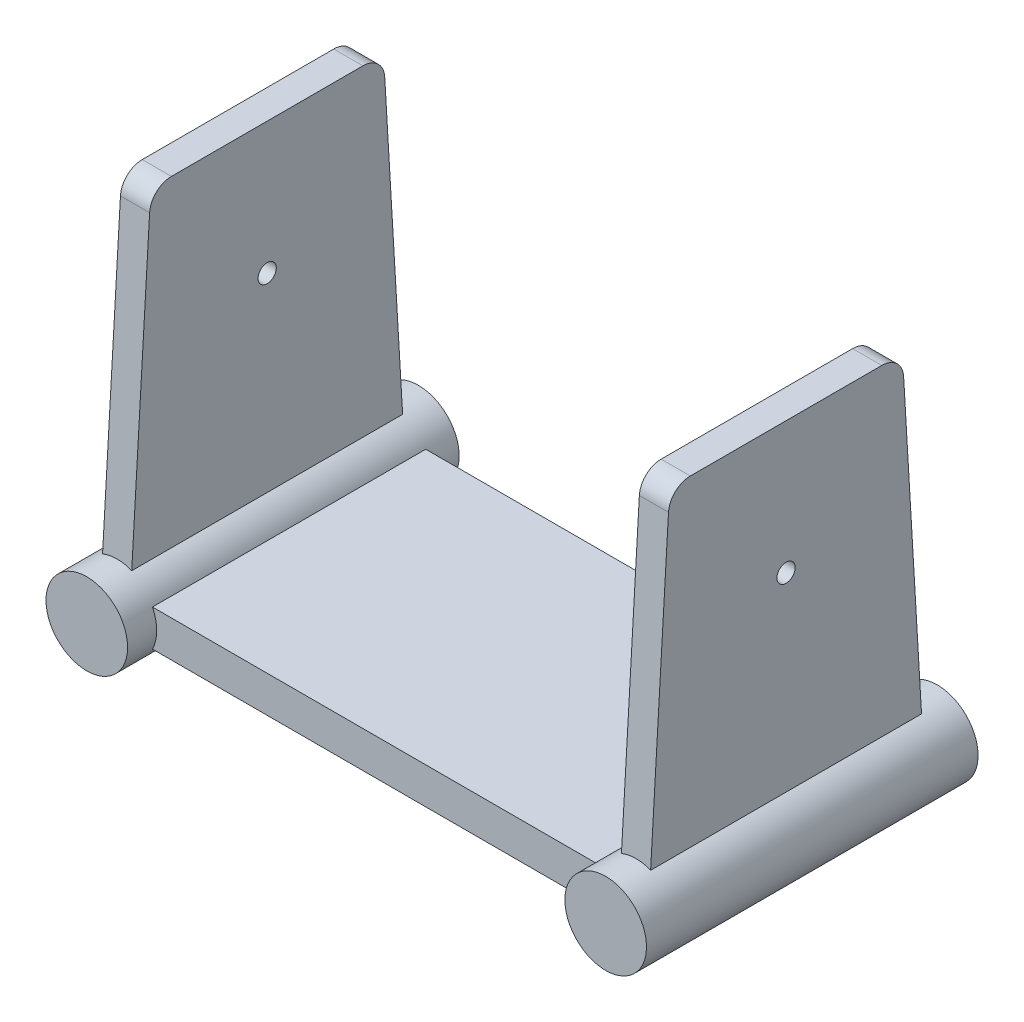
ISO-10303-21;
HEADER;
FILE_DESCRIPTION(('STEP AP214'),'2;1');
FILE_NAME('part.step','',(''),(''),'','','');
FILE_SCHEMA(('AUTOMOTIVE_DESIGN { 1 0 10303 214 1 1 1 1 }'));
ENDSEC;
DATA;
#1=APPLICATION_CONTEXT('core data for automotive mechanical design processes');
#2=APPLICATION_PROTOCOL_DEFINITION('international standard','automotive_design',2000,#1);
#3=PRODUCT_CONTEXT('',#1,'mechanical');
#4=PRODUCT('Part','Part','',(#3));
#5=PRODUCT_RELATED_PRODUCT_CATEGORY('part','',(#4));
#6=PRODUCT_DEFINITION_FORMATION('','',#4);
#7=PRODUCT_DEFINITION_CONTEXT('part definition',#1,'design');
#8=PRODUCT_DEFINITION('design','',#6,#7);
#9=PRODUCT_DEFINITION_SHAPE('','',#8);
#10=(LENGTH_UNIT() NAMED_UNIT(*) SI_UNIT(.MILLI.,.METRE.));
#11=(NAMED_UNIT(*) PLANE_ANGLE_UNIT() SI_UNIT($,.RADIAN.));
#12=(NAMED_UNIT(*) SI_UNIT($,.STERADIAN.) SOLID_ANGLE_UNIT());
#13=UNCERTAINTY_MEASURE_WITH_UNIT(LENGTH_MEASURE(1.E-05),#10,'distance_accuracy_value','');
#14=(GEOMETRIC_REPRESENTATION_CONTEXT(3) GLOBAL_UNCERTAINTY_ASSIGNED_CONTEXT((#13)) GLOBAL_UNIT_ASSIGNED_CONTEXT((#10,
#11,#12)) REPRESENTATION_CONTEXT('',''));
#15=CARTESIAN_POINT('',(0.,0.,0.));
#16=DIRECTION('',(0.,0.,1.));
#17=DIRECTION('',(1.,0.,0.));
#18=AXIS2_PLACEMENT_3D('',#15,#16,#17);
#19=CARTESIAN_POINT('',(31.,2.16090265707052,0.));
#20=DIRECTION('',(-1.,0.,0.));
#21=DIRECTION('',(0.,0.,1.));
#22=AXIS2_PLACEMENT_3D('',#19,#20,#21);
#23=CYLINDRICAL_SURFACE('',#22,24.7637771143478);
#24=CARTESIAN_POINT('',(23.,2.16090265707052,0.));
#25=DIRECTION('',(-1.,0.,0.));
#26=DIRECTION('',(0.,-1.,0.));
#27=AXIS2_PLACEMENT_3D('',#24,#25,#26);
#28=CIRCLE('',#27,24.7637771143478);
#29=CARTESIAN_POINT('',(23.,0.,-24.6693160966364));
#30=VERTEX_POINT('',#29);
#31=CARTESIAN_POINT('',(23.,0.,24.6693160966364));
#32=VERTEX_POINT('',#31);
#33=EDGE_CURVE('E174',#30,#32,#28,.T.);
#34=ORIENTED_EDGE('',*,*,#33,.F.);
#35=DIRECTION('',(-1.,0.,0.));
#36=VECTOR('',#35,1.);
#37=CARTESIAN_POINT('',(31.,0.,-24.6693160966364));
#38=LINE('',#37,#36);
#39=CARTESIAN_POINT('',(31.,0.,-24.6693160966364));
#40=VERTEX_POINT('',#39);
#41=EDGE_CURVE('E188',#40,#30,#38,.T.);
#42=ORIENTED_EDGE('',*,*,#41,.F.);
#43=CARTESIAN_POINT('',(31.,2.16090265707052,0.));
#44=DIRECTION('',(1.,0.,0.));
#45=DIRECTION('',(0.,0.,-1.));
#46=AXIS2_PLACEMENT_3D('',#43,#44,#45);
#47=CIRCLE('',#46,24.7637771143478);
#48=CARTESIAN_POINT('',(31.,0.,24.6693160966364));
#49=VERTEX_POINT('',#48);
#50=EDGE_CURVE('E192',#49,#40,#47,.T.);
#51=ORIENTED_EDGE('',*,*,#50,.F.);
#52=DIRECTION('',(-1.,0.,0.));
#53=VECTOR('',#52,1.);
#54=CARTESIAN_POINT('',(31.,0.,24.6693160966364));
#55=LINE('',#54,#53);
#56=EDGE_CURVE('E187',#49,#32,#55,.T.);
#57=ORIENTED_EDGE('',*,*,#56,.T.);
#58=EDGE_LOOP('',(#34,#42,#51,#57));
#59=FACE_BOUND('',#58,.T.);
#60=ADVANCED_FACE('F36',(#59),#23,.T.);
#61=CARTESIAN_POINT('',(31.,-11.5170913712345,0.));
#62=DIRECTION('',(-1.,0.,0.));
#63=DIRECTION('',(0.,0.,1.));
#64=AXIS2_PLACEMENT_3D('',#61,#62,#63);
#65=CYLINDRICAL_SURFACE('',#64,4.16745947265569);
#66=CARTESIAN_POINT('',(31.,-11.5170913712345,0.));
#67=DIRECTION('',(1.,0.,0.));
#68=DIRECTION('',(0.,0.,-1.));
#69=AXIS2_PLACEMENT_3D('',#66,#67,#68);
#70=CIRCLE('',#69,4.16745947265569);
#71=CARTESIAN_POINT('',(31.,-11.5170913712345,-4.16745947265569));
#72=VERTEX_POINT('',#71);
#73=EDGE_CURVE('E361',#72,#72,#70,.T.);
#74=ORIENTED_EDGE('',*,*,#73,.T.);
#75=EDGE_LOOP('',(#74));
#76=FACE_BOUND('',#75,.T.);
#77=CARTESIAN_POINT('',(23.,-11.5170913712345,0.));
#78=DIRECTION('',(-1.,0.,0.));
#79=DIRECTION('',(0.,-1.,0.));
#80=AXIS2_PLACEMENT_3D('',#77,#78,#79);
#81=CIRCLE('',#80,4.16745947265569);
#82=CARTESIAN_POINT('',(23.,-15.6845508438902,0.));
#83=VERTEX_POINT('',#82);
#84=EDGE_CURVE('E180',#83,#83,#81,.T.);
#85=ORIENTED_EDGE('',*,*,#84,.T.);
#86=EDGE_LOOP('',(#85));
#87=FACE_BOUND('',#86,.T.);
#88=ADVANCED_FACE('F386',(#76,#87),#65,.F.);
#89=CARTESIAN_POINT('',(0.,0.,0.));
#90=DIRECTION('',(0.,-1.,0.));
#91=DIRECTION('',(0.,0.,-1.));
#92=AXIS2_PLACEMENT_3D('',#89,#90,#91);
#93=PLANE('',#92);
#94=CARTESIAN_POINT('',(-23.,0.,24.6693160966364));
#95=VERTEX_POINT('',#94);
#96=CARTESIAN_POINT('',(-31.,0.,24.6693160966364));
#97=VERTEX_POINT('',#96);
#98=EDGE_CURVE('E193',#95,#97,#55,.T.);
#99=ORIENTED_EDGE('',*,*,#98,.F.);
#100=DIRECTION('',(0.,0.,1.));
#101=VECTOR('',#100,1.);
#102=CARTESIAN_POINT('',(-23.,0.,-31.));
#103=LINE('',#102,#101);
#104=CARTESIAN_POINT('',(-23.,0.,-24.6693160966364));
#105=VERTEX_POINT('',#104);
#106=EDGE_CURVE('E189',#105,#95,#103,.T.);
#107=ORIENTED_EDGE('',*,*,#106,.F.);
#108=CARTESIAN_POINT('',(-31.,0.,-24.6693160966364));
#109=VERTEX_POINT('',#108);
#110=EDGE_CURVE('E60',#105,#109,#38,.T.);
#111=ORIENTED_EDGE('',*,*,#110,.T.);
#112=DIRECTION('',(0.,0.,1.));
#113=VECTOR('',#112,1.);
#114=CARTESIAN_POINT('',(-31.,0.,24.6693160966364));
#115=LINE('',#114,#113);
#116=EDGE_CURVE('E198',#109,#97,#115,.T.);
#117=ORIENTED_EDGE('',*,*,#116,.T.);
#118=EDGE_LOOP('',(#99,#107,#111,#117));
#119=FACE_BOUND('',#118,.T.);
#120=DIRECTION('',(0.,0.,1.));
#121=VECTOR('',#120,1.);
#122=CARTESIAN_POINT('',(23.,0.,-31.));
#123=LINE('',#122,#121);
#124=EDGE_CURVE('E52',#30,#32,#123,.T.);
#125=ORIENTED_EDGE('',*,*,#124,.T.);
#126=ORIENTED_EDGE('',*,*,#56,.F.);
#127=DIRECTION('',(0.,0.,1.));
#128=VECTOR('',#127,1.);
#129=CARTESIAN_POINT('',(31.,0.,0.));
#130=LINE('',#129,#128);
#131=EDGE_CURVE('E196',#40,#49,#130,.T.);
#132=ORIENTED_EDGE('',*,*,#131,.F.);
#133=ORIENTED_EDGE('',*,*,#41,.T.);
#134=EDGE_LOOP('',(#125,#126,#132,#133));
#135=FACE_BOUND('',#134,.T.);
#136=DIRECTION('',(0.,0.,1.));
#137=VECTOR('',#136,1.);
#138=CARTESIAN_POINT('',(61.1635916192774,0.,-69.1331155501186));
#139=LINE('',#138,#137);
#140=CARTESIAN_POINT('',(61.1635916192774,0.,37.4834226761167));
#141=VERTEX_POINT('',#140);
#142=CARTESIAN_POINT('',(61.1635916192774,0.,-37.4834226761167));
#143=VERTEX_POINT('',#142);
#144=EDGE_CURVE('E232',#141,#143,#139,.F.);
#145=ORIENTED_EDGE('',*,*,#144,.F.);
#146=DIRECTION('',(1.,0.,0.));
#147=VECTOR('',#146,1.);
#148=CARTESIAN_POINT('',(-71.1742300793023,0.,37.4834226761167));
#149=LINE('',#148,#147);
#150=CARTESIAN_POINT('',(-61.1635916192774,0.,37.4834226761167));
#151=VERTEX_POINT('',#150);
#152=EDGE_CURVE('E286',#151,#141,#149,.T.);
#153=ORIENTED_EDGE('',*,*,#152,.F.);
#154=DIRECTION('',(0.,0.,1.));
#155=VECTOR('',#154,1.);
#156=CARTESIAN_POINT('',(-61.1635916192774,0.,-69.1331155501186));
#157=LINE('',#156,#155);
#158=CARTESIAN_POINT('',(-61.1635916192774,0.,-37.4834226761167));
#159=VERTEX_POINT('',#158);
#160=EDGE_CURVE('E242',#159,#151,#157,.T.);
#161=ORIENTED_EDGE('',*,*,#160,.F.);
#162=DIRECTION('',(-1.,0.,0.));
#163=VECTOR('',#162,1.);
#164=CARTESIAN_POINT('',(-71.1742300793023,0.,-37.4834226761167));
#165=LINE('',#164,#163);
#166=EDGE_CURVE('E277',#143,#159,#165,.T.);
#167=ORIENTED_EDGE('',*,*,#166,.F.);
#168=EDGE_LOOP('',(#145,#153,#161,#167));
#169=FACE_BOUND('',#168,.T.);
#170=ADVANCED_FACE('F184',(#119,#135,#169),#93,.T.);
#171=CARTESIAN_POINT('',(71.1742300793023,5.,45.4834226761167));
#172=DIRECTION('',(0.,0.,-1.));
#173=DIRECTION('',(-1.,0.,0.));
#174=AXIS2_PLACEMENT_3D('',#171,#172,#173);
#175=CYLINDRICAL_SURFACE('',#174,11.1898562268392);
#176=CARTESIAN_POINT('',(71.1742300793023,5.,-45.4834226761167));
#177=DIRECTION('',(0.,0.,-1.));
#178=DIRECTION('',(-1.,0.,0.));
#179=AXIS2_PLACEMENT_3D('',#176,#177,#178);
#180=CIRCLE('',#179,11.1898562268392);
#181=CARTESIAN_POINT('',(59.9843738524632,5.,-45.4834226761167));
#182=VERTEX_POINT('',#181);
#183=EDGE_CURVE('E227',#182,#182,#180,.T.);
#184=ORIENTED_EDGE('',*,*,#183,.F.);
#185=EDGE_LOOP('',(#184));
#186=FACE_BOUND('',#185,.T.);
#187=CARTESIAN_POINT('',(71.1742300793023,5.,37.4834226761167));
#188=DIRECTION('',(0.,0.,1.));
#189=DIRECTION('',(-1.,0.,0.));
#190=AXIS2_PLACEMENT_3D('',#187,#188,#189);
#191=CIRCLE('',#190,11.1898562268392);
#192=CARTESIAN_POINT('',(61.1635916192774,10.,37.4834226761167));
#193=VERTEX_POINT('',#192);
#194=EDGE_CURVE('E262',#193,#141,#191,.T.);
#195=ORIENTED_EDGE('',*,*,#194,.T.);
#196=ORIENTED_EDGE('',*,*,#144,.T.);
#197=CARTESIAN_POINT('',(71.1742300793023,5.,-37.4834226761167));
#198=DIRECTION('',(0.,0.,-1.));
#199=DIRECTION('',(-1.,0.,0.));
#200=AXIS2_PLACEMENT_3D('',#197,#198,#199);
#201=CIRCLE('',#200,11.1898562268392);
#202=CARTESIAN_POINT('',(61.1635916192774,10.,-37.4834226761167));
#203=VERTEX_POINT('',#202);
#204=EDGE_CURVE('E291',#143,#203,#201,.T.);
#205=ORIENTED_EDGE('',*,*,#204,.T.);
#206=DIRECTION('',(0.,0.,1.));
#207=VECTOR('',#206,1.);
#208=CARTESIAN_POINT('',(61.1635916192774,10.,-69.1331155501186));
#209=LINE('',#208,#207);
#210=EDGE_CURVE('E237',#193,#203,#209,.F.);
#211=ORIENTED_EDGE('',*,*,#210,.F.);
#212=EDGE_LOOP('',(#195,#196,#205,#211));
#213=FACE_BOUND('',#212,.T.);
#214=CARTESIAN_POINT('',(71.1742300793023,5.,45.4834226761167));
#215=DIRECTION('',(0.,0.,1.));
#216=DIRECTION('',(-1.,0.,0.));
#217=AXIS2_PLACEMENT_3D('',#214,#215,#216);
#218=CIRCLE('',#217,11.1898562268392);
#219=CARTESIAN_POINT('',(59.9843738524632,5.,45.4834226761167));
#220=VERTEX_POINT('',#219);
#221=EDGE_CURVE('E269',#220,#220,#218,.T.);
#222=ORIENTED_EDGE('',*,*,#221,.F.);
#223=EDGE_LOOP('',(#222));
#224=FACE_BOUND('',#223,.T.);
#225=DIRECTION('',(0.,0.,-1.));
#226=VECTOR('',#225,1.);
#227=CARTESIAN_POINT('',(75.1742300793023,15.4504967526587,45.4834226761167));
#228=LINE('',#227,#226);
#229=CARTESIAN_POINT('',(75.1742300793023,15.4504967526588,37.1595172850928));
#230=VERTEX_POINT('',#229);
#231=CARTESIAN_POINT('',(75.1742300793023,15.4504967526587,-37.1595172850928));
#232=VERTEX_POINT('',#231);
#233=EDGE_CURVE('E317',#230,#232,#228,.T.);
#234=ORIENTED_EDGE('',*,*,#233,.F.);
#235=CARTESIAN_POINT('',(71.1742300793023,5.,37.7805565023738));
#236=DIRECTION('',(0.,0.0593221083580241,0.998238892981013));
#237=DIRECTION('',(0.,0.998238892981013,-0.0593221083580241));
#238=AXIS2_PLACEMENT_3D('',#235,#236,#237);
#239=ELLIPSE('',#238,11.2095975277252,11.1898562268392);
#240=CARTESIAN_POINT('',(67.1742300793023,15.4504967526588,37.1595172850928));
#241=VERTEX_POINT('',#240);
#242=EDGE_CURVE('E311',#230,#241,#239,.T.);
#243=ORIENTED_EDGE('',*,*,#242,.T.);
#244=DIRECTION('',(0.,0.,-1.));
#245=VECTOR('',#244,1.);
#246=CARTESIAN_POINT('',(67.1742300793023,15.4504967526587,45.4834226761167));
#247=LINE('',#246,#245);
#248=CARTESIAN_POINT('',(67.1742300793023,15.4504967526587,-37.1595172850928));
#249=VERTEX_POINT('',#248);
#250=EDGE_CURVE('E299',#241,#249,#247,.T.);
#251=ORIENTED_EDGE('',*,*,#250,.T.);
#252=CARTESIAN_POINT('',(71.1742300793023,5.,-37.7805565023738));
#253=DIRECTION('',(0.,0.0593221083580241,-0.998238892981013));
#254=DIRECTION('',(0.,-0.998238892981013,-0.0593221083580241));
#255=AXIS2_PLACEMENT_3D('',#252,#253,#254);
#256=ELLIPSE('',#255,11.2095975277252,11.1898562268392);
#257=EDGE_CURVE('E314',#249,#232,#256,.T.);
#258=ORIENTED_EDGE('',*,*,#257,.T.);
#259=EDGE_LOOP('',(#234,#243,#251,#258));
#260=FACE_BOUND('',#259,.T.);
#261=ADVANCED_FACE('F465',(#186,#213,#224,#260),#175,.T.);
#262=CARTESIAN_POINT('',(-71.1742300793023,10.,-37.4834226761167));
#263=DIRECTION('',(0.,0.,1.));
#264=DIRECTION('',(1.,0.,0.));
#265=AXIS2_PLACEMENT_3D('',#262,#263,#264);
#266=PLANE('',#265);
#267=CARTESIAN_POINT('',(-71.1742300793023,5.,-37.4834226761167));
#268=DIRECTION('',(0.,0.,-1.));
#269=DIRECTION('',(-1.,0.,0.));
#270=AXIS2_PLACEMENT_3D('',#267,#268,#269);
#271=CIRCLE('',#270,11.1898562268392);
#272=CARTESIAN_POINT('',(-61.1635916192774,10.,-37.4834226761167));
#273=VERTEX_POINT('',#272);
#274=EDGE_CURVE('E217',#273,#159,#271,.T.);
#275=ORIENTED_EDGE('',*,*,#274,.F.);
#276=DIRECTION('',(-1.,0.,0.));
#277=VECTOR('',#276,1.);
#278=CARTESIAN_POINT('',(-71.1742300793023,10.,-37.4834226761167));
#279=LINE('',#278,#277);
#280=EDGE_CURVE('E285',#203,#273,#279,.T.);
#281=ORIENTED_EDGE('',*,*,#280,.F.);
#282=ORIENTED_EDGE('',*,*,#204,.F.);
#283=ORIENTED_EDGE('',*,*,#166,.T.);
#284=EDGE_LOOP('',(#275,#281,#282,#283));
#285=FACE_BOUND('',#284,.T.);
#286=ADVANCED_FACE('F468',(#285),#266,.F.);
#287=CARTESIAN_POINT('',(-71.1742300793023,10.,37.4834226761167));
#288=DIRECTION('',(0.,0.,-1.));
#289=DIRECTION('',(-1.,0.,0.));
#290=AXIS2_PLACEMENT_3D('',#287,#288,#289);
#291=PLANE('',#290);
#292=ORIENTED_EDGE('',*,*,#194,.F.);
#293=DIRECTION('',(1.,0.,0.));
#294=VECTOR('',#293,1.);
#295=CARTESIAN_POINT('',(-71.1742300793023,10.,37.4834226761167));
#296=LINE('',#295,#294);
#297=CARTESIAN_POINT('',(-61.1635916192774,10.,37.4834226761167));
#298=VERTEX_POINT('',#297);
#299=EDGE_CURVE('E282',#298,#193,#296,.T.);
#300=ORIENTED_EDGE('',*,*,#299,.F.);
#301=CARTESIAN_POINT('',(-71.1742300793023,5.,37.4834226761167));
#302=DIRECTION('',(0.,0.,1.));
#303=DIRECTION('',(1.,0.,0.));
#304=AXIS2_PLACEMENT_3D('',#301,#302,#303);
#305=CIRCLE('',#304,11.1898562268392);
#306=EDGE_CURVE('E278',#151,#298,#305,.T.);
#307=ORIENTED_EDGE('',*,*,#306,.F.);
#308=ORIENTED_EDGE('',*,*,#152,.T.);
#309=EDGE_LOOP('',(#292,#300,#307,#308));
#310=FACE_BOUND('',#309,.T.);
#311=ADVANCED_FACE('F480',(#310),#291,.F.);
#312=CARTESIAN_POINT('',(0.,10.,0.));
#313=DIRECTION('',(0.,-1.,0.));
#314=DIRECTION('',(0.,0.,-1.));
#315=AXIS2_PLACEMENT_3D('',#312,#313,#314);
#316=PLANE('',#315);
#317=ORIENTED_EDGE('',*,*,#299,.T.);
#318=ORIENTED_EDGE('',*,*,#210,.T.);
#319=ORIENTED_EDGE('',*,*,#280,.T.);
#320=DIRECTION('',(0.,0.,1.));
#321=VECTOR('',#320,1.);
#322=CARTESIAN_POINT('',(-61.1635916192774,10.,-69.1331155501186));
#323=LINE('',#322,#321);
#324=EDGE_CURVE('E244',#273,#298,#323,.T.);
#325=ORIENTED_EDGE('',*,*,#324,.T.);
#326=EDGE_LOOP('',(#317,#318,#319,#325));
#327=FACE_BOUND('',#326,.T.);
#328=ADVANCED_FACE('F476',(#327),#316,.F.);
#329=CARTESIAN_POINT('',(-71.1742300793023,5.,45.4834226761167));
#330=DIRECTION('',(0.,0.,-1.));
#331=DIRECTION('',(-1.,0.,0.));
#332=AXIS2_PLACEMENT_3D('',#329,#330,#331);
#333=CYLINDRICAL_SURFACE('',#332,11.1898562268392);
#334=CARTESIAN_POINT('',(-71.1742300793023,5.,45.4834226761167));
#335=DIRECTION('',(0.,0.,1.));
#336=DIRECTION('',(1.,0.,0.));
#337=AXIS2_PLACEMENT_3D('',#334,#335,#336);
#338=CIRCLE('',#337,11.1898562268392);
#339=CARTESIAN_POINT('',(-59.9843738524632,5.,45.4834226761167));
#340=VERTEX_POINT('',#339);
#341=EDGE_CURVE('E272',#340,#340,#338,.T.);
#342=ORIENTED_EDGE('',*,*,#341,.F.);
#343=EDGE_LOOP('',(#342));
#344=FACE_BOUND('',#343,.T.);
#345=ORIENTED_EDGE('',*,*,#306,.T.);
#346=ORIENTED_EDGE('',*,*,#324,.F.);
#347=ORIENTED_EDGE('',*,*,#274,.T.);
#348=ORIENTED_EDGE('',*,*,#160,.T.);
#349=EDGE_LOOP('',(#345,#346,#347,#348));
#350=FACE_BOUND('',#349,.T.);
#351=CARTESIAN_POINT('',(-71.1742300793023,5.,37.7805565023738));
#352=DIRECTION('',(0.,-0.0593221083580241,-0.998238892981013));
#353=DIRECTION('',(0.,-0.998238892981013,0.0593221083580241));
#354=AXIS2_PLACEMENT_3D('',#351,#352,#353);
#355=ELLIPSE('',#354,11.2095975277253,11.1898562268392);
#356=CARTESIAN_POINT('',(-75.1742300793023,15.4504967526588,37.1595172850927));
#357=VERTEX_POINT('',#356);
#358=CARTESIAN_POINT('',(-67.1742300793023,15.4504967526588,37.1595172850927));
#359=VERTEX_POINT('',#358);
#360=EDGE_CURVE('E239',#357,#359,#355,.T.);
#361=ORIENTED_EDGE('',*,*,#360,.F.);
#362=DIRECTION('',(0.,0.,1.));
#363=VECTOR('',#362,1.);
#364=CARTESIAN_POINT('',(-75.1742300793023,15.4504967526588,-69.1331155501186));
#365=LINE('',#364,#363);
#366=CARTESIAN_POINT('',(-75.1742300793023,15.4504967526588,-37.1595172850928));
#367=VERTEX_POINT('',#366);
#368=EDGE_CURVE('E233',#367,#357,#365,.T.);
#369=ORIENTED_EDGE('',*,*,#368,.F.);
#370=CARTESIAN_POINT('',(-71.1742300793023,5.,-37.7805565023738));
#371=DIRECTION('',(0.,-0.0593221083580241,0.998238892981013));
#372=DIRECTION('',(0.,0.998238892981013,0.0593221083580241));
#373=AXIS2_PLACEMENT_3D('',#370,#371,#372);
#374=ELLIPSE('',#373,11.2095975277253,11.1898562268392);
#375=CARTESIAN_POINT('',(-67.1742300793023,15.4504967526588,-37.1595172850928));
#376=VERTEX_POINT('',#375);
#377=EDGE_CURVE('E281',#376,#367,#374,.T.);
#378=ORIENTED_EDGE('',*,*,#377,.F.);
#379=DIRECTION('',(0.,0.,1.));
#380=VECTOR('',#379,1.);
#381=CARTESIAN_POINT('',(-67.1742300793023,15.4504967526588,-69.1331155501186));
#382=LINE('',#381,#380);
#383=EDGE_CURVE('E236',#376,#359,#382,.T.);
#384=ORIENTED_EDGE('',*,*,#383,.T.);
#385=EDGE_LOOP('',(#361,#369,#378,#384));
#386=FACE_BOUND('',#385,.T.);
#387=CARTESIAN_POINT('',(-71.1742300793023,5.,-45.4834226761167));
#388=DIRECTION('',(0.,0.,-1.));
#389=DIRECTION('',(-1.,0.,0.));
#390=AXIS2_PLACEMENT_3D('',#387,#388,#389);
#391=CIRCLE('',#390,11.1898562268392);
#392=CARTESIAN_POINT('',(-82.3640863061415,5.,-45.4834226761167));
#393=VERTEX_POINT('',#392);
#394=EDGE_CURVE('E224',#393,#393,#391,.T.);
#395=ORIENTED_EDGE('',*,*,#394,.F.);
#396=EDGE_LOOP('',(#395));
#397=FACE_BOUND('',#396,.T.);
#398=ADVANCED_FACE('F472',(#344,#350,#386,#397),#333,.T.);
#399=CARTESIAN_POINT('',(-71.1742300793023,5.,45.4834226761167));
#400=DIRECTION('',(0.,0.,1.));
#401=DIRECTION('',(1.,0.,0.));
#402=AXIS2_PLACEMENT_3D('',#399,#400,#401);
#403=PLANE('',#402);
#404=ORIENTED_EDGE('',*,*,#341,.T.);
#405=EDGE_LOOP('',(#404));
#406=FACE_BOUND('',#405,.T.);
#407=ADVANCED_FACE('F463',(#406),#403,.T.);
#408=CARTESIAN_POINT('',(71.1742300793023,5.,45.4834226761167));
#409=DIRECTION('',(0.,0.,-1.));
#410=DIRECTION('',(-1.,0.,0.));
#411=AXIS2_PLACEMENT_3D('',#408,#409,#410);
#412=PLANE('',#411);
#413=ORIENTED_EDGE('',*,*,#221,.T.);
#414=EDGE_LOOP('',(#413));
#415=FACE_BOUND('',#414,.T.);
#416=ADVANCED_FACE('F441',(#415),#412,.F.);
#417=CARTESIAN_POINT('',(-75.1742300793023,67.5631746599247,0.));
#418=DIRECTION('',(1.,0.,0.));
#419=DIRECTION('',(0.,0.,-1.));
#420=AXIS2_PLACEMENT_3D('',#417,#418,#419);
#421=CYLINDRICAL_SURFACE('',#420,2.5);
#422=CARTESIAN_POINT('',(-75.1742300793023,67.5631746599247,0.));
#423=DIRECTION('',(-1.,0.,0.));
#424=DIRECTION('',(0.,0.,1.));
#425=AXIS2_PLACEMENT_3D('',#422,#423,#424);
#426=CIRCLE('',#425,2.5);
#427=CARTESIAN_POINT('',(-75.1742300793023,67.5631746599247,2.5));
#428=VERTEX_POINT('',#427);
#429=EDGE_CURVE('E247',#428,#428,#426,.T.);
#430=ORIENTED_EDGE('',*,*,#429,.T.);
#431=EDGE_LOOP('',(#430));
#432=FACE_BOUND('',#431,.T.);
#433=CARTESIAN_POINT('',(-67.1742300793023,67.5631746599247,0.));
#434=DIRECTION('',(-1.,0.,0.));
#435=DIRECTION('',(0.,0.,1.));
#436=AXIS2_PLACEMENT_3D('',#433,#434,#435);
#437=CIRCLE('',#436,2.5);
#438=CARTESIAN_POINT('',(-67.1742300793023,67.5631746599247,2.5));
#439=VERTEX_POINT('',#438);
#440=EDGE_CURVE('E246',#439,#439,#437,.T.);
#441=ORIENTED_EDGE('',*,*,#440,.F.);
#442=EDGE_LOOP('',(#441));
#443=FACE_BOUND('',#442,.T.);
#444=ADVANCED_FACE('F437',(#432,#443),#421,.F.);
#445=CARTESIAN_POINT('',(-75.1742300793023,103.689607920406,-31.9157523397328));
#446=DIRECTION('',(0.,-1.,0.));
#447=DIRECTION('',(0.,0.,-1.));
#448=AXIS2_PLACEMENT_3D('',#445,#446,#447);
#449=PLANE('',#448);
#450=DIRECTION('',(0.,0.,-1.));
#451=VECTOR('',#450,1.);
#452=CARTESIAN_POINT('',(-75.1742300793023,103.689607920406,0.));
#453=LINE('',#452,#451);
#454=CARTESIAN_POINT('',(-75.1742300793023,103.689607920406,26.2617276473096));
#455=VERTEX_POINT('',#454);
#456=CARTESIAN_POINT('',(-75.1742300793023,103.689607920406,-26.2617276473096));
#457=VERTEX_POINT('',#456);
#458=EDGE_CURVE('E256',#455,#457,#453,.T.);
#459=ORIENTED_EDGE('',*,*,#458,.F.);
#460=DIRECTION('',(1.,0.,0.));
#461=VECTOR('',#460,1.);
#462=CARTESIAN_POINT('',(-75.1742300793023,103.689607920406,26.2617276473096));
#463=LINE('',#462,#461);
#464=CARTESIAN_POINT('',(-67.1742300793023,103.689607920406,26.2617276473096));
#465=VERTEX_POINT('',#464);
#466=EDGE_CURVE('E340',#455,#465,#463,.T.);
#467=ORIENTED_EDGE('',*,*,#466,.T.);
#468=DIRECTION('',(0.,0.,-1.));
#469=VECTOR('',#468,1.);
#470=CARTESIAN_POINT('',(-67.1742300793023,103.689607920406,-31.9157523397328));
#471=LINE('',#470,#469);
#472=CARTESIAN_POINT('',(-67.1742300793023,103.689607920406,-26.2617276473096));
#473=VERTEX_POINT('',#472);
#474=EDGE_CURVE('E265',#465,#473,#471,.T.);
#475=ORIENTED_EDGE('',*,*,#474,.T.);
#476=DIRECTION('',(1.,0.,0.));
#477=VECTOR('',#476,1.);
#478=CARTESIAN_POINT('',(-75.1742300793023,103.689607920406,-26.2617276473096));
#479=LINE('',#478,#477);
#480=EDGE_CURVE('E338',#473,#457,#479,.F.);
#481=ORIENTED_EDGE('',*,*,#480,.T.);
#482=EDGE_LOOP('',(#459,#467,#475,#481));
#483=FACE_BOUND('',#482,.T.);
#484=ADVANCED_FACE('F440',(#483),#449,.F.);
#485=CARTESIAN_POINT('',(-75.1742300793023,103.689607920406,31.9157523397328));
#486=DIRECTION('',(0.,-0.0593221083580241,-0.998238892981013));
#487=DIRECTION('',(0.,0.998238892981013,-0.0593221083580241));
#488=AXIS2_PLACEMENT_3D('',#485,#486,#487);
#489=PLANE('',#488);
#490=DIRECTION('',(0.,0.998238892981013,-0.0593221083580241));
#491=VECTOR('',#490,1.);
#492=CARTESIAN_POINT('',(-67.1742300793023,103.689607920406,31.9157523397328));
#493=LINE('',#492,#491);
#494=CARTESIAN_POINT('',(-67.1742300793023,98.0455405705537,32.2511610051956));
#495=VERTEX_POINT('',#494);
#496=EDGE_CURVE('E250',#359,#495,#493,.T.);
#497=ORIENTED_EDGE('',*,*,#496,.T.);
#498=DIRECTION('',(1.,0.,0.));
#499=VECTOR('',#498,1.);
#500=CARTESIAN_POINT('',(-75.1742300793023,98.0455405705537,32.2511610051956));
#501=LINE('',#500,#499);
#502=CARTESIAN_POINT('',(-75.1742300793023,98.0455405705537,32.2511610051956));
#503=VERTEX_POINT('',#502);
#504=EDGE_CURVE('E347',#495,#503,#501,.F.);
#505=ORIENTED_EDGE('',*,*,#504,.T.);
#506=DIRECTION('',(0.,0.998238892981013,-0.0593221083580241));
#507=VECTOR('',#506,1.);
#508=CARTESIAN_POINT('',(-75.1742300793023,103.689607920406,31.9157523397328));
#509=LINE('',#508,#507);
#510=EDGE_CURVE('E253',#357,#503,#509,.T.);
#511=ORIENTED_EDGE('',*,*,#510,.F.);
#512=ORIENTED_EDGE('',*,*,#360,.T.);
#513=EDGE_LOOP('',(#497,#505,#511,#512));
#514=FACE_BOUND('',#513,.T.);
#515=ADVANCED_FACE('F453',(#514),#489,.F.);
#516=CARTESIAN_POINT('',(-75.1742300793023,10.,-37.4834226761167));
#517=DIRECTION('',(0.,-0.0593221083580241,0.998238892981013));
#518=DIRECTION('',(0.,-0.998238892981013,-0.0593221083580241));
#519=AXIS2_PLACEMENT_3D('',#516,#517,#518);
#520=PLANE('',#519);
#521=DIRECTION('',(0.,-0.998238892981013,-0.0593221083580241));
#522=VECTOR('',#521,1.);
#523=CARTESIAN_POINT('',(-75.1742300793023,10.,-37.4834226761167));
#524=LINE('',#523,#522);
#525=CARTESIAN_POINT('',(-75.1742300793023,98.0455405705537,-32.2511610051956));
#526=VERTEX_POINT('',#525);
#527=EDGE_CURVE('E260',#526,#367,#524,.T.);
#528=ORIENTED_EDGE('',*,*,#527,.F.);
#529=DIRECTION('',(1.,0.,0.));
#530=VECTOR('',#529,1.);
#531=CARTESIAN_POINT('',(-75.1742300793023,98.0455405705537,-32.2511610051956));
#532=LINE('',#531,#530);
#533=CARTESIAN_POINT('',(-67.1742300793023,98.0455405705537,-32.2511610051956));
#534=VERTEX_POINT('',#533);
#535=EDGE_CURVE('E11',#526,#534,#532,.T.);
#536=ORIENTED_EDGE('',*,*,#535,.T.);
#537=DIRECTION('',(0.,-0.998238892981013,-0.0593221083580241));
#538=VECTOR('',#537,1.);
#539=CARTESIAN_POINT('',(-67.1742300793023,10.,-37.4834226761167));
#540=LINE('',#539,#538);
#541=EDGE_CURVE('E257',#534,#376,#540,.T.);
#542=ORIENTED_EDGE('',*,*,#541,.T.);
#543=ORIENTED_EDGE('',*,*,#377,.T.);
#544=EDGE_LOOP('',(#528,#536,#542,#543));
#545=FACE_BOUND('',#544,.T.);
#546=ADVANCED_FACE('F446',(#545),#520,.F.);
#547=CARTESIAN_POINT('',(-75.1742300793023,0.,0.));
#548=DIRECTION('',(1.,0.,0.));
#549=DIRECTION('',(0.,0.,-1.));
#550=AXIS2_PLACEMENT_3D('',#547,#548,#549);
#551=PLANE('',#550);
#552=ORIENTED_EDGE('',*,*,#510,.T.);
#553=CARTESIAN_POINT('',(-75.1742300793023,97.6896079204055,26.2617276473096));
#554=DIRECTION('',(1.,0.,0.));
#555=DIRECTION('',(0.,0.,-1.));
#556=AXIS2_PLACEMENT_3D('',#553,#554,#555);
#557=CIRCLE('',#556,6.);
#558=EDGE_CURVE('E45',#503,#455,#557,.F.);
#559=ORIENTED_EDGE('',*,*,#558,.T.);
#560=ORIENTED_EDGE('',*,*,#458,.T.);
#561=CARTESIAN_POINT('',(-75.1742300793023,97.6896079204055,-26.2617276473096));
#562=DIRECTION('',(1.,0.,0.));
#563=DIRECTION('',(0.,0.,-1.));
#564=AXIS2_PLACEMENT_3D('',#561,#562,#563);
#565=CIRCLE('',#564,6.);
#566=EDGE_CURVE('E349',#457,#526,#565,.F.);
#567=ORIENTED_EDGE('',*,*,#566,.T.);
#568=ORIENTED_EDGE('',*,*,#527,.T.);
#569=ORIENTED_EDGE('',*,*,#368,.T.);
#570=EDGE_LOOP('',(#552,#559,#560,#567,#568,#569));
#571=FACE_BOUND('',#570,.T.);
#572=ORIENTED_EDGE('',*,*,#429,.F.);
#573=EDGE_LOOP('',(#572));
#574=FACE_BOUND('',#573,.T.);
#575=ADVANCED_FACE('F443',(#571,#574),#551,.F.);
#576=CARTESIAN_POINT('',(-67.1742300793023,0.,0.));
#577=DIRECTION('',(1.,0.,0.));
#578=DIRECTION('',(0.,0.,-1.));
#579=AXIS2_PLACEMENT_3D('',#576,#577,#578);
#580=PLANE('',#579);
#581=ORIENTED_EDGE('',*,*,#474,.F.);
#582=CARTESIAN_POINT('',(-67.1742300793023,97.6896079204055,26.2617276473096));
#583=DIRECTION('',(1.,0.,0.));
#584=DIRECTION('',(0.,0.,-1.));
#585=AXIS2_PLACEMENT_3D('',#582,#583,#584);
#586=CIRCLE('',#585,6.);
#587=EDGE_CURVE('E345',#465,#495,#586,.T.);
#588=ORIENTED_EDGE('',*,*,#587,.T.);
#589=ORIENTED_EDGE('',*,*,#496,.F.);
#590=ORIENTED_EDGE('',*,*,#383,.F.);
#591=ORIENTED_EDGE('',*,*,#541,.F.);
#592=CARTESIAN_POINT('',(-67.1742300793023,97.6896079204055,-26.2617276473096));
#593=DIRECTION('',(1.,0.,0.));
#594=DIRECTION('',(0.,0.,-1.));
#595=AXIS2_PLACEMENT_3D('',#592,#593,#594);
#596=CIRCLE('',#595,6.);
#597=EDGE_CURVE('E343',#534,#473,#596,.T.);
#598=ORIENTED_EDGE('',*,*,#597,.T.);
#599=EDGE_LOOP('',(#581,#588,#589,#590,#591,#598));
#600=FACE_BOUND('',#599,.T.);
#601=ORIENTED_EDGE('',*,*,#440,.T.);
#602=EDGE_LOOP('',(#601));
#603=FACE_BOUND('',#602,.T.);
#604=ADVANCED_FACE('F435',(#600,#603),#580,.T.);
#605=CARTESIAN_POINT('',(71.1742300793023,5.,-45.4834226761167));
#606=DIRECTION('',(0.,0.,-1.));
#607=DIRECTION('',(-1.,0.,0.));
#608=AXIS2_PLACEMENT_3D('',#605,#606,#607);
#609=PLANE('',#608);
#610=ORIENTED_EDGE('',*,*,#183,.T.);
#611=EDGE_LOOP('',(#610));
#612=FACE_BOUND('',#611,.T.);
#613=ADVANCED_FACE('F431',(#612),#609,.T.);
#614=CARTESIAN_POINT('',(-71.1742300793023,5.,-45.4834226761167));
#615=DIRECTION('',(0.,0.,-1.));
#616=DIRECTION('',(-1.,0.,0.));
#617=AXIS2_PLACEMENT_3D('',#614,#615,#616);
#618=PLANE('',#617);
#619=ORIENTED_EDGE('',*,*,#394,.T.);
#620=EDGE_LOOP('',(#619));
#621=FACE_BOUND('',#620,.T.);
#622=ADVANCED_FACE('F427',(#621),#618,.T.);
#623=CARTESIAN_POINT('',(75.1742300793023,10.,-37.4834226761167));
#624=DIRECTION('',(0.,0.0593221083580241,-0.998238892981013));
#625=DIRECTION('',(0.,0.998238892981013,0.0593221083580241));
#626=AXIS2_PLACEMENT_3D('',#623,#624,#625);
#627=PLANE('',#626);
#628=DIRECTION('',(0.,-0.998238892981013,-0.0593221083580241));
#629=VECTOR('',#628,1.);
#630=CARTESIAN_POINT('',(67.1742300793023,10.,-37.4834226761167));
#631=LINE('',#630,#629);
#632=CARTESIAN_POINT('',(67.1742300793023,98.0455405705537,-32.2511610051956));
#633=VERTEX_POINT('',#632);
#634=EDGE_CURVE('E205',#633,#249,#631,.T.);
#635=ORIENTED_EDGE('',*,*,#634,.F.);
#636=DIRECTION('',(-1.,0.,0.));
#637=VECTOR('',#636,1.);
#638=CARTESIAN_POINT('',(75.1742300793023,98.0455405705537,-32.2511610051956));
#639=LINE('',#638,#637);
#640=CARTESIAN_POINT('',(75.1742300793023,98.0455405705537,-32.2511610051956));
#641=VERTEX_POINT('',#640);
#642=EDGE_CURVE('E329',#633,#641,#639,.F.);
#643=ORIENTED_EDGE('',*,*,#642,.T.);
#644=DIRECTION('',(0.,-0.998238892981013,-0.0593221083580241));
#645=VECTOR('',#644,1.);
#646=CARTESIAN_POINT('',(75.1742300793023,10.,-37.4834226761167));
#647=LINE('',#646,#645);
#648=EDGE_CURVE('E208',#641,#232,#647,.T.);
#649=ORIENTED_EDGE('',*,*,#648,.T.);
#650=ORIENTED_EDGE('',*,*,#257,.F.);
#651=EDGE_LOOP('',(#635,#643,#649,#650));
#652=FACE_BOUND('',#651,.T.);
#653=ADVANCED_FACE('F420',(#652),#627,.T.);
#654=CARTESIAN_POINT('',(75.1742300793023,103.689607920406,31.9157523397328));
#655=DIRECTION('',(0.,0.0593221083580241,0.998238892981013));
#656=DIRECTION('',(0.,-0.998238892981013,0.0593221083580241));
#657=AXIS2_PLACEMENT_3D('',#654,#655,#656);
#658=PLANE('',#657);
#659=DIRECTION('',(0.,0.998238892981013,-0.0593221083580241));
#660=VECTOR('',#659,1.);
#661=CARTESIAN_POINT('',(75.1742300793023,103.689607920406,31.9157523397328));
#662=LINE('',#661,#660);
#663=CARTESIAN_POINT('',(75.1742300793023,98.0455405705537,32.2511610051956));
#664=VERTEX_POINT('',#663);
#665=EDGE_CURVE('E214',#230,#664,#662,.T.);
#666=ORIENTED_EDGE('',*,*,#665,.T.);
#667=DIRECTION('',(-1.,0.,0.));
#668=VECTOR('',#667,1.);
#669=CARTESIAN_POINT('',(75.1742300793023,98.0455405705537,32.2511610051956));
#670=LINE('',#669,#668);
#671=CARTESIAN_POINT('',(67.1742300793023,98.0455405705537,32.2511610051956));
#672=VERTEX_POINT('',#671);
#673=EDGE_CURVE('E335',#664,#672,#670,.T.);
#674=ORIENTED_EDGE('',*,*,#673,.T.);
#675=DIRECTION('',(0.,0.998238892981013,-0.0593221083580241));
#676=VECTOR('',#675,1.);
#677=CARTESIAN_POINT('',(67.1742300793023,103.689607920406,31.9157523397328));
#678=LINE('',#677,#676);
#679=EDGE_CURVE('E211',#241,#672,#678,.T.);
#680=ORIENTED_EDGE('',*,*,#679,.F.);
#681=ORIENTED_EDGE('',*,*,#242,.F.);
#682=EDGE_LOOP('',(#666,#674,#680,#681));
#683=FACE_BOUND('',#682,.T.);
#684=ADVANCED_FACE('F413',(#683),#658,.T.);
#685=CARTESIAN_POINT('',(75.1742300793023,0.,0.));
#686=DIRECTION('',(-1.,0.,0.));
#687=DIRECTION('',(0.,0.,-1.));
#688=AXIS2_PLACEMENT_3D('',#685,#686,#687);
#689=PLANE('',#688);
#690=CARTESIAN_POINT('',(75.1742300793023,67.5631746599247,0.));
#691=DIRECTION('',(-1.,0.,0.));
#692=DIRECTION('',(0.,0.,1.));
#693=AXIS2_PLACEMENT_3D('',#690,#691,#692);
#694=CIRCLE('',#693,2.5);
#695=CARTESIAN_POINT('',(75.1742300793023,67.5631746599247,2.5));
#696=VERTEX_POINT('',#695);
#697=EDGE_CURVE('E202',#696,#696,#694,.T.);
#698=ORIENTED_EDGE('',*,*,#697,.T.);
#699=EDGE_LOOP('',(#698));
#700=FACE_BOUND('',#699,.T.);
#701=ORIENTED_EDGE('',*,*,#648,.F.);
#702=CARTESIAN_POINT('',(75.1742300793023,97.6896079204055,-26.2617276473096));
#703=DIRECTION('',(-1.,0.,0.));
#704=DIRECTION('',(0.,0.,1.));
#705=AXIS2_PLACEMENT_3D('',#702,#703,#704);
#706=CIRCLE('',#705,6.);
#707=CARTESIAN_POINT('',(75.1742300793023,103.689607920406,-26.2617276473096));
#708=VERTEX_POINT('',#707);
#709=EDGE_CURVE('E333',#641,#708,#706,.F.);
#710=ORIENTED_EDGE('',*,*,#709,.T.);
#711=DIRECTION('',(0.,0.,-1.));
#712=VECTOR('',#711,1.);
#713=CARTESIAN_POINT('',(75.1742300793023,103.689607920406,-31.9157523397328));
#714=LINE('',#713,#712);
#715=CARTESIAN_POINT('',(75.1742300793023,103.689607920406,26.2617276473096));
#716=VERTEX_POINT('',#715);
#717=EDGE_CURVE('E210',#716,#708,#714,.T.);
#718=ORIENTED_EDGE('',*,*,#717,.F.);
#719=CARTESIAN_POINT('',(75.1742300793023,97.6896079204055,26.2617276473096));
#720=DIRECTION('',(-1.,0.,0.));
#721=DIRECTION('',(0.,0.,1.));
#722=AXIS2_PLACEMENT_3D('',#719,#720,#721);
#723=CIRCLE('',#722,6.);
#724=EDGE_CURVE('E331',#716,#664,#723,.F.);
#725=ORIENTED_EDGE('',*,*,#724,.T.);
#726=ORIENTED_EDGE('',*,*,#665,.F.);
#727=ORIENTED_EDGE('',*,*,#233,.T.);
#728=EDGE_LOOP('',(#701,#710,#718,#725,#726,#727));
#729=FACE_BOUND('',#728,.T.);
#730=ADVANCED_FACE('F409',(#700,#729),#689,.F.);
#731=CARTESIAN_POINT('',(67.1742300793023,0.,0.));
#732=DIRECTION('',(-1.,0.,0.));
#733=DIRECTION('',(0.,0.,-1.));
#734=AXIS2_PLACEMENT_3D('',#731,#732,#733);
#735=PLANE('',#734);
#736=CARTESIAN_POINT('',(67.1742300793023,67.5631746599247,0.));
#737=DIRECTION('',(-1.,0.,0.));
#738=DIRECTION('',(0.,0.,1.));
#739=AXIS2_PLACEMENT_3D('',#736,#737,#738);
#740=CIRCLE('',#739,2.5);
#741=CARTESIAN_POINT('',(67.1742300793023,67.5631746599247,2.5));
#742=VERTEX_POINT('',#741);
#743=EDGE_CURVE('E201',#742,#742,#740,.T.);
#744=ORIENTED_EDGE('',*,*,#743,.F.);
#745=EDGE_LOOP('',(#744));
#746=FACE_BOUND('',#745,.T.);
#747=DIRECTION('',(0.,0.,-1.));
#748=VECTOR('',#747,1.);
#749=CARTESIAN_POINT('',(67.1742300793023,103.689607920406,0.));
#750=LINE('',#749,#748);
#751=CARTESIAN_POINT('',(67.1742300793023,103.689607920406,26.2617276473096));
#752=VERTEX_POINT('',#751);
#753=CARTESIAN_POINT('',(67.1742300793023,103.689607920406,-26.2617276473096));
#754=VERTEX_POINT('',#753);
#755=EDGE_CURVE('E219',#752,#754,#750,.T.);
#756=ORIENTED_EDGE('',*,*,#755,.T.);
#757=CARTESIAN_POINT('',(67.1742300793023,97.6896079204055,-26.2617276473096));
#758=DIRECTION('',(-1.,0.,0.));
#759=DIRECTION('',(0.,0.,1.));
#760=AXIS2_PLACEMENT_3D('',#757,#758,#759);
#761=CIRCLE('',#760,6.);
#762=EDGE_CURVE('E327',#754,#633,#761,.T.);
#763=ORIENTED_EDGE('',*,*,#762,.T.);
#764=ORIENTED_EDGE('',*,*,#634,.T.);
#765=ORIENTED_EDGE('',*,*,#250,.F.);
#766=ORIENTED_EDGE('',*,*,#679,.T.);
#767=CARTESIAN_POINT('',(67.1742300793023,97.6896079204055,26.2617276473096));
#768=DIRECTION('',(-1.,0.,0.));
#769=DIRECTION('',(0.,0.,1.));
#770=AXIS2_PLACEMENT_3D('',#767,#768,#769);
#771=CIRCLE('',#770,6.);
#772=EDGE_CURVE('E325',#672,#752,#771,.T.);
#773=ORIENTED_EDGE('',*,*,#772,.T.);
#774=EDGE_LOOP('',(#756,#763,#764,#765,#766,#773));
#775=FACE_BOUND('',#774,.T.);
#776=ADVANCED_FACE('F412',(#746,#775),#735,.T.);
#777=CARTESIAN_POINT('',(75.1742300793023,103.689607920406,0.));
#778=DIRECTION('',(0.,1.,0.));
#779=DIRECTION('',(0.,0.,1.));
#780=AXIS2_PLACEMENT_3D('',#777,#778,#779);
#781=PLANE('',#780);
#782=ORIENTED_EDGE('',*,*,#717,.T.);
#783=DIRECTION('',(-1.,0.,0.));
#784=VECTOR('',#783,1.);
#785=CARTESIAN_POINT('',(75.1742300793023,103.689607920406,-26.2617276473096));
#786=LINE('',#785,#784);
#787=EDGE_CURVE('E322',#708,#754,#786,.T.);
#788=ORIENTED_EDGE('',*,*,#787,.T.);
#789=ORIENTED_EDGE('',*,*,#755,.F.);
#790=DIRECTION('',(-1.,0.,0.));
#791=VECTOR('',#790,1.);
#792=CARTESIAN_POINT('',(75.1742300793023,103.689607920406,26.2617276473096));
#793=LINE('',#792,#791);
#794=EDGE_CURVE('E320',#752,#716,#793,.F.);
#795=ORIENTED_EDGE('',*,*,#794,.T.);
#796=EDGE_LOOP('',(#782,#788,#789,#795));
#797=FACE_BOUND('',#796,.T.);
#798=ADVANCED_FACE('F407',(#797),#781,.T.);
#799=CARTESIAN_POINT('',(75.1742300793023,67.5631746599247,0.));
#800=DIRECTION('',(-1.,0.,0.));
#801=DIRECTION('',(0.,0.,1.));
#802=AXIS2_PLACEMENT_3D('',#799,#800,#801);
#803=CYLINDRICAL_SURFACE('',#802,2.5);
#804=ORIENTED_EDGE('',*,*,#697,.F.);
#805=EDGE_LOOP('',(#804));
#806=FACE_BOUND('',#805,.T.);
#807=ORIENTED_EDGE('',*,*,#743,.T.);
#808=EDGE_LOOP('',(#807));
#809=FACE_BOUND('',#808,.T.);
#810=ADVANCED_FACE('F403',(#806,#809),#803,.F.);
#811=CARTESIAN_POINT('',(75.1742300793023,97.6896079204055,-26.2617276473096));
#812=DIRECTION('',(-1.,0.,0.));
#813=DIRECTION('',(0.,0.,1.));
#814=AXIS2_PLACEMENT_3D('',#811,#812,#813);
#815=CYLINDRICAL_SURFACE('',#814,6.);
#816=ORIENTED_EDGE('',*,*,#709,.F.);
#817=ORIENTED_EDGE('',*,*,#642,.F.);
#818=ORIENTED_EDGE('',*,*,#762,.F.);
#819=ORIENTED_EDGE('',*,*,#787,.F.);
#820=EDGE_LOOP('',(#816,#817,#818,#819));
#821=FACE_BOUND('',#820,.T.);
#822=ADVANCED_FACE('F406',(#821),#815,.T.);
#823=CARTESIAN_POINT('',(75.1742300793023,97.6896079204055,26.2617276473096));
#824=DIRECTION('',(-1.,0.,0.));
#825=DIRECTION('',(0.,0.,1.));
#826=AXIS2_PLACEMENT_3D('',#823,#824,#825);
#827=CYLINDRICAL_SURFACE('',#826,6.);
#828=ORIENTED_EDGE('',*,*,#724,.F.);
#829=ORIENTED_EDGE('',*,*,#794,.F.);
#830=ORIENTED_EDGE('',*,*,#772,.F.);
#831=ORIENTED_EDGE('',*,*,#673,.F.);
#832=EDGE_LOOP('',(#828,#829,#830,#831));
#833=FACE_BOUND('',#832,.T.);
#834=ADVANCED_FACE('F492',(#833),#827,.T.);
#835=CARTESIAN_POINT('',(-75.1742300793023,97.6896079204055,26.2617276473096));
#836=DIRECTION('',(1.,0.,0.));
#837=DIRECTION('',(0.,0.,-1.));
#838=AXIS2_PLACEMENT_3D('',#835,#836,#837);
#839=CYLINDRICAL_SURFACE('',#838,6.);
#840=ORIENTED_EDGE('',*,*,#558,.F.);
#841=ORIENTED_EDGE('',*,*,#504,.F.);
#842=ORIENTED_EDGE('',*,*,#587,.F.);
#843=ORIENTED_EDGE('',*,*,#466,.F.);
#844=EDGE_LOOP('',(#840,#841,#842,#843));
#845=FACE_BOUND('',#844,.T.);
#846=ADVANCED_FACE('F495',(#845),#839,.T.);
#847=CARTESIAN_POINT('',(-75.1742300793023,97.6896079204055,-26.2617276473096));
#848=DIRECTION('',(1.,0.,0.));
#849=DIRECTION('',(0.,0.,-1.));
#850=AXIS2_PLACEMENT_3D('',#847,#848,#849);
#851=CYLINDRICAL_SURFACE('',#850,6.);
#852=ORIENTED_EDGE('',*,*,#566,.F.);
#853=ORIENTED_EDGE('',*,*,#480,.F.);
#854=ORIENTED_EDGE('',*,*,#597,.F.);
#855=ORIENTED_EDGE('',*,*,#535,.F.);
#856=EDGE_LOOP('',(#852,#853,#854,#855));
#857=FACE_BOUND('',#856,.T.);
#858=ADVANCED_FACE('F38',(#857),#851,.T.);
#859=CARTESIAN_POINT('',(31.,2.16090265707052,0.));
#860=DIRECTION('',(1.,0.,0.));
#861=DIRECTION('',(0.,0.,-1.));
#862=AXIS2_PLACEMENT_3D('',#859,#860,#861);
#863=PLANE('',#862);
#864=ORIENTED_EDGE('',*,*,#50,.T.);
#865=ORIENTED_EDGE('',*,*,#131,.T.);
#866=EDGE_LOOP('',(#864,#865));
#867=FACE_BOUND('',#866,.T.);
#868=ORIENTED_EDGE('',*,*,#73,.F.);
#869=EDGE_LOOP('',(#868));
#870=FACE_BOUND('',#869,.T.);
#871=ADVANCED_FACE('F377',(#867,#870),#863,.T.);
#872=CARTESIAN_POINT('',(-31.,2.16090265707052,0.));
#873=DIRECTION('',(1.,0.,0.));
#874=DIRECTION('',(0.,0.,-1.));
#875=AXIS2_PLACEMENT_3D('',#872,#873,#874);
#876=PLANE('',#875);
#877=CARTESIAN_POINT('',(-31.,2.16090265707052,0.));
#878=DIRECTION('',(1.,0.,0.));
#879=DIRECTION('',(0.,0.,-1.));
#880=AXIS2_PLACEMENT_3D('',#877,#878,#879);
#881=CIRCLE('',#880,24.7637771143478);
#882=EDGE_CURVE('E364',#97,#109,#881,.T.);
#883=ORIENTED_EDGE('',*,*,#882,.F.);
#884=ORIENTED_EDGE('',*,*,#116,.F.);
#885=EDGE_LOOP('',(#883,#884));
#886=FACE_BOUND('',#885,.T.);
#887=CARTESIAN_POINT('',(-31.,-11.5170913712345,0.));
#888=DIRECTION('',(1.,0.,0.));
#889=DIRECTION('',(0.,0.,-1.));
#890=AXIS2_PLACEMENT_3D('',#887,#888,#889);
#891=CIRCLE('',#890,4.16745947265569);
#892=CARTESIAN_POINT('',(-31.,-11.5170913712345,-4.16745947265569));
#893=VERTEX_POINT('',#892);
#894=EDGE_CURVE('E360',#893,#893,#891,.T.);
#895=ORIENTED_EDGE('',*,*,#894,.T.);
#896=EDGE_LOOP('',(#895));
#897=FACE_BOUND('',#896,.T.);
#898=ADVANCED_FACE('F373',(#886,#897),#876,.F.);
#899=ORIENTED_EDGE('',*,*,#110,.F.);
#900=CARTESIAN_POINT('',(-23.,2.16090265707052,0.));
#901=DIRECTION('',(-1.,0.,0.));
#902=DIRECTION('',(0.,-1.,0.));
#903=AXIS2_PLACEMENT_3D('',#900,#901,#902);
#904=CIRCLE('',#903,24.7637771143478);
#905=EDGE_CURVE('E358',#105,#95,#904,.T.);
#906=ORIENTED_EDGE('',*,*,#905,.T.);
#907=ORIENTED_EDGE('',*,*,#98,.T.);
#908=ORIENTED_EDGE('',*,*,#882,.T.);
#909=EDGE_LOOP('',(#899,#906,#907,#908));
#910=FACE_BOUND('',#909,.T.);
#911=ADVANCED_FACE('F376',(#910),#23,.T.);
#912=CARTESIAN_POINT('',(-23.,-11.5170913712345,0.));
#913=DIRECTION('',(-1.,0.,0.));
#914=DIRECTION('',(0.,-1.,0.));
#915=AXIS2_PLACEMENT_3D('',#912,#913,#914);
#916=CIRCLE('',#915,4.16745947265569);
#917=CARTESIAN_POINT('',(-23.,-15.6845508438902,0.));
#918=VERTEX_POINT('',#917);
#919=EDGE_CURVE('E40',#918,#918,#916,.T.);
#920=ORIENTED_EDGE('',*,*,#919,.F.);
#921=EDGE_LOOP('',(#920));
#922=FACE_BOUND('',#921,.T.);
#923=ORIENTED_EDGE('',*,*,#894,.F.);
#924=EDGE_LOOP('',(#923));
#925=FACE_BOUND('',#924,.T.);
#926=ADVANCED_FACE('F381',(#922,#925),#65,.F.);
#927=CARTESIAN_POINT('',(-23.,0.,-31.));
#928=DIRECTION('',(-1.,0.,0.));
#929=DIRECTION('',(0.,-1.,0.));
#930=AXIS2_PLACEMENT_3D('',#927,#928,#929);
#931=PLANE('',#930);
#932=ORIENTED_EDGE('',*,*,#919,.T.);
#933=EDGE_LOOP('',(#932));
#934=FACE_BOUND('',#933,.T.);
#935=ORIENTED_EDGE('',*,*,#106,.T.);
#936=ORIENTED_EDGE('',*,*,#905,.F.);
#937=EDGE_LOOP('',(#935,#936));
#938=FACE_BOUND('',#937,.T.);
#939=ADVANCED_FACE('F383',(#934,#938),#931,.F.);
#940=CARTESIAN_POINT('',(23.,0.,-31.));
#941=DIRECTION('',(-1.,0.,0.));
#942=DIRECTION('',(0.,-1.,0.));
#943=AXIS2_PLACEMENT_3D('',#940,#941,#942);
#944=PLANE('',#943);
#945=ORIENTED_EDGE('',*,*,#84,.F.);
#946=EDGE_LOOP('',(#945));
#947=FACE_BOUND('',#946,.T.);
#948=ORIENTED_EDGE('',*,*,#33,.T.);
#949=ORIENTED_EDGE('',*,*,#124,.F.);
#950=EDGE_LOOP('',(#948,#949));
#951=FACE_BOUND('',#950,.T.);
#952=ADVANCED_FACE('F175',(#947,#951),#944,.T.);
#953=CLOSED_SHELL('',(#60,#88,#170,#261,#286,#311,#328,#398,#407,#416,#444,#484,#515,#546,#575,
#604,#613,#622,#653,#684,#730,#776,#798,#810,#822,#834,#846,#858,#871,#898,#911,#926,#939,#952));
#954=MANIFOLD_SOLID_BREP('B2',#953);
#955=ADVANCED_BREP_SHAPE_REPRESENTATION('',(#18,#954),#14);
#956=SHAPE_DEFINITION_REPRESENTATION(#9,#955);
ENDSEC;
END-ISO-10303-21;
